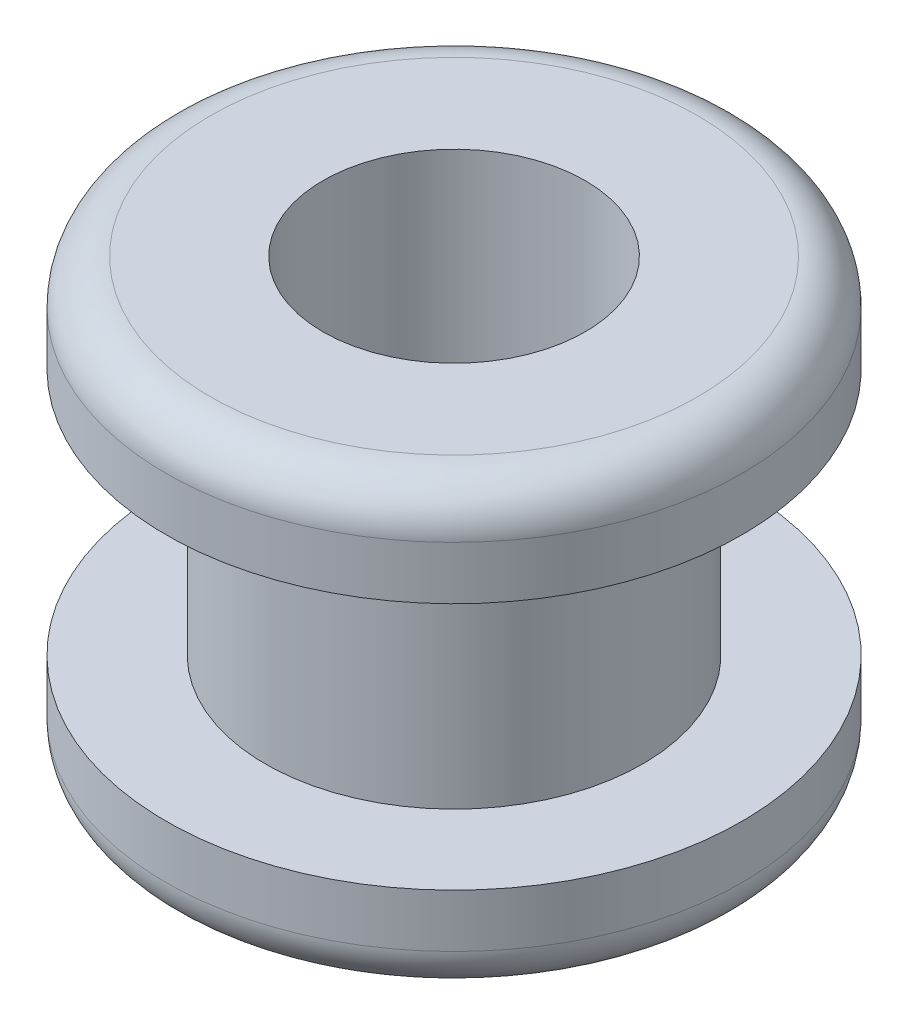
ISO-10303-21;
HEADER;
FILE_DESCRIPTION(('STEP AP214'),'2;1');
FILE_NAME('part.step','',(''),(''),'','','');
FILE_SCHEMA(('AUTOMOTIVE_DESIGN { 1 0 10303 214 1 1 1 1 }'));
ENDSEC;
DATA;
#1=APPLICATION_CONTEXT('core data for automotive mechanical design processes');
#2=APPLICATION_PROTOCOL_DEFINITION('international standard','automotive_design',2000,#1);
#3=PRODUCT_CONTEXT('',#1,'mechanical');
#4=PRODUCT('Part','Part','',(#3));
#5=PRODUCT_RELATED_PRODUCT_CATEGORY('part','',(#4));
#6=PRODUCT_DEFINITION_FORMATION('','',#4);
#7=PRODUCT_DEFINITION_CONTEXT('part definition',#1,'design');
#8=PRODUCT_DEFINITION('design','',#6,#7);
#9=PRODUCT_DEFINITION_SHAPE('','',#8);
#10=(LENGTH_UNIT() NAMED_UNIT(*) SI_UNIT(.MILLI.,.METRE.));
#11=(NAMED_UNIT(*) PLANE_ANGLE_UNIT() SI_UNIT($,.RADIAN.));
#12=(NAMED_UNIT(*) SI_UNIT($,.STERADIAN.) SOLID_ANGLE_UNIT());
#13=UNCERTAINTY_MEASURE_WITH_UNIT(LENGTH_MEASURE(1.E-05),#10,'distance_accuracy_value','');
#14=(GEOMETRIC_REPRESENTATION_CONTEXT(3) GLOBAL_UNCERTAINTY_ASSIGNED_CONTEXT((#13)) GLOBAL_UNIT_ASSIGNED_CONTEXT((#10,
#11,#12)) REPRESENTATION_CONTEXT('',''));
#15=CARTESIAN_POINT('',(0.,0.,0.));
#16=DIRECTION('',(0.,0.,1.));
#17=DIRECTION('',(1.,0.,0.));
#18=AXIS2_PLACEMENT_3D('',#15,#16,#17);
#19=CARTESIAN_POINT('',(0.,0.,0.));
#20=DIRECTION('',(0.,-1.,0.));
#21=DIRECTION('',(0.,0.,-1.));
#22=AXIS2_PLACEMENT_3D('',#19,#20,#21);
#23=CYLINDRICAL_SURFACE('',#22,1.48);
#24=CARTESIAN_POINT('',(0.,2.5,0.));
#25=DIRECTION('',(0.,-1.,0.));
#26=DIRECTION('',(0.,0.,-1.));
#27=AXIS2_PLACEMENT_3D('',#24,#25,#26);
#28=CIRCLE('',#27,1.48);
#29=CARTESIAN_POINT('',(0.,2.5,-1.48));
#30=VERTEX_POINT('',#29);
#31=EDGE_CURVE('E10',#30,#30,#28,.T.);
#32=ORIENTED_EDGE('',*,*,#31,.F.);
#33=EDGE_LOOP('',(#32));
#34=FACE_BOUND('',#33,.T.);
#35=CARTESIAN_POINT('',(0.,-2.5,0.));
#36=DIRECTION('',(0.,-1.,0.));
#37=DIRECTION('',(0.,0.,-1.));
#38=AXIS2_PLACEMENT_3D('',#35,#36,#37);
#39=CIRCLE('',#38,1.48);
#40=CARTESIAN_POINT('',(0.,-2.5,-1.48));
#41=VERTEX_POINT('',#40);
#42=EDGE_CURVE('E65',#41,#41,#39,.T.);
#43=ORIENTED_EDGE('',*,*,#42,.T.);
#44=EDGE_LOOP('',(#43));
#45=FACE_BOUND('',#44,.T.);
#46=ADVANCED_FACE('F31',(#34,#45),#23,.F.);
#47=CARTESIAN_POINT('',(-2.75,2.5,0.));
#48=DIRECTION('',(0.,-1.,0.));
#49=DIRECTION('',(0.,0.,-1.));
#50=AXIS2_PLACEMENT_3D('',#47,#48,#49);
#51=PLANE('',#50);
#52=CARTESIAN_POINT('',(0.,2.5,0.));
#53=DIRECTION('',(0.,-1.,0.));
#54=DIRECTION('',(0.,0.,-1.));
#55=AXIS2_PLACEMENT_3D('',#52,#53,#54);
#56=CIRCLE('',#55,2.75);
#57=CARTESIAN_POINT('',(0.,2.5,-2.75));
#58=VERTEX_POINT('',#57);
#59=EDGE_CURVE('E37',#58,#58,#56,.T.);
#60=ORIENTED_EDGE('',*,*,#59,.F.);
#61=EDGE_LOOP('',(#60));
#62=FACE_BOUND('',#61,.T.);
#63=ORIENTED_EDGE('',*,*,#31,.T.);
#64=EDGE_LOOP('',(#63));
#65=FACE_BOUND('',#64,.T.);
#66=ADVANCED_FACE('F114',(#62,#65),#51,.F.);
#67=CARTESIAN_POINT('',(0.,2.,0.));
#68=DIRECTION('',(0.,-1.,0.));
#69=DIRECTION('',(0.,0.,-1.));
#70=AXIS2_PLACEMENT_3D('',#67,#68,#69);
#71=TOROIDAL_SURFACE('',#70,2.75,0.5);
#72=CARTESIAN_POINT('',(0.,2.,0.));
#73=DIRECTION('',(0.,-1.,0.));
#74=DIRECTION('',(0.,0.,-1.));
#75=AXIS2_PLACEMENT_3D('',#72,#73,#74);
#76=CIRCLE('',#75,3.25);
#77=CARTESIAN_POINT('',(0.,2.,-3.25));
#78=VERTEX_POINT('',#77);
#79=EDGE_CURVE('E41',#78,#78,#76,.T.);
#80=ORIENTED_EDGE('',*,*,#79,.F.);
#81=EDGE_LOOP('',(#80));
#82=FACE_BOUND('',#81,.T.);
#83=ORIENTED_EDGE('',*,*,#59,.T.);
#84=EDGE_LOOP('',(#83));
#85=FACE_BOUND('',#84,.T.);
#86=ADVANCED_FACE('F109',(#82,#85),#71,.T.);
#87=CARTESIAN_POINT('',(0.,0.,0.));
#88=DIRECTION('',(0.,-1.,0.));
#89=DIRECTION('',(0.,0.,-1.));
#90=AXIS2_PLACEMENT_3D('',#87,#88,#89);
#91=CYLINDRICAL_SURFACE('',#90,3.25);
#92=CARTESIAN_POINT('',(0.,1.4,0.));
#93=DIRECTION('',(0.,-1.,0.));
#94=DIRECTION('',(0.,0.,-1.));
#95=AXIS2_PLACEMENT_3D('',#92,#93,#94);
#96=CIRCLE('',#95,3.25);
#97=CARTESIAN_POINT('',(0.,1.4,-3.25));
#98=VERTEX_POINT('',#97);
#99=EDGE_CURVE('E45',#98,#98,#96,.T.);
#100=ORIENTED_EDGE('',*,*,#99,.F.);
#101=EDGE_LOOP('',(#100));
#102=FACE_BOUND('',#101,.T.);
#103=ORIENTED_EDGE('',*,*,#79,.T.);
#104=EDGE_LOOP('',(#103));
#105=FACE_BOUND('',#104,.T.);
#106=ADVANCED_FACE('F103',(#102,#105),#91,.T.);
#107=CARTESIAN_POINT('',(-3.25,1.4,0.));
#108=DIRECTION('',(0.,1.,0.));
#109=DIRECTION('',(0.,0.,1.));
#110=AXIS2_PLACEMENT_3D('',#107,#108,#109);
#111=PLANE('',#110);
#112=CARTESIAN_POINT('',(0.,1.4,0.));
#113=DIRECTION('',(0.,-1.,0.));
#114=DIRECTION('',(0.,0.,-1.));
#115=AXIS2_PLACEMENT_3D('',#112,#113,#114);
#116=CIRCLE('',#115,2.13);
#117=CARTESIAN_POINT('',(0.,1.4,-2.13));
#118=VERTEX_POINT('',#117);
#119=EDGE_CURVE('E50',#118,#118,#116,.T.);
#120=ORIENTED_EDGE('',*,*,#119,.F.);
#121=EDGE_LOOP('',(#120));
#122=FACE_BOUND('',#121,.T.);
#123=ORIENTED_EDGE('',*,*,#99,.T.);
#124=EDGE_LOOP('',(#123));
#125=FACE_BOUND('',#124,.T.);
#126=ADVANCED_FACE('F97',(#122,#125),#111,.F.);
#127=CARTESIAN_POINT('',(0.,0.,0.));
#128=DIRECTION('',(0.,-1.,0.));
#129=DIRECTION('',(0.,0.,-1.));
#130=AXIS2_PLACEMENT_3D('',#127,#128,#129);
#131=CYLINDRICAL_SURFACE('',#130,2.13);
#132=CARTESIAN_POINT('',(0.,-1.4,0.));
#133=DIRECTION('',(0.,-1.,0.));
#134=DIRECTION('',(0.,0.,-1.));
#135=AXIS2_PLACEMENT_3D('',#132,#133,#134);
#136=CIRCLE('',#135,2.13);
#137=CARTESIAN_POINT('',(0.,-1.4,-2.13));
#138=VERTEX_POINT('',#137);
#139=EDGE_CURVE('E53',#138,#138,#136,.T.);
#140=ORIENTED_EDGE('',*,*,#139,.F.);
#141=EDGE_LOOP('',(#140));
#142=FACE_BOUND('',#141,.T.);
#143=ORIENTED_EDGE('',*,*,#119,.T.);
#144=EDGE_LOOP('',(#143));
#145=FACE_BOUND('',#144,.T.);
#146=ADVANCED_FACE('F91',(#142,#145),#131,.T.);
#147=CARTESIAN_POINT('',(-3.25,-1.4,0.));
#148=DIRECTION('',(0.,-1.,0.));
#149=DIRECTION('',(0.,0.,-1.));
#150=AXIS2_PLACEMENT_3D('',#147,#148,#149);
#151=PLANE('',#150);
#152=CARTESIAN_POINT('',(0.,-1.4,0.));
#153=DIRECTION('',(0.,-1.,0.));
#154=DIRECTION('',(0.,0.,-1.));
#155=AXIS2_PLACEMENT_3D('',#152,#153,#154);
#156=CIRCLE('',#155,3.25);
#157=CARTESIAN_POINT('',(0.,-1.4,-3.25));
#158=VERTEX_POINT('',#157);
#159=EDGE_CURVE('E56',#158,#158,#156,.T.);
#160=ORIENTED_EDGE('',*,*,#159,.F.);
#161=EDGE_LOOP('',(#160));
#162=FACE_BOUND('',#161,.T.);
#163=ORIENTED_EDGE('',*,*,#139,.T.);
#164=EDGE_LOOP('',(#163));
#165=FACE_BOUND('',#164,.T.);
#166=ADVANCED_FACE('F85',(#162,#165),#151,.F.);
#167=CARTESIAN_POINT('',(0.,0.,0.));
#168=DIRECTION('',(0.,-1.,0.));
#169=DIRECTION('',(0.,0.,-1.));
#170=AXIS2_PLACEMENT_3D('',#167,#168,#169);
#171=CYLINDRICAL_SURFACE('',#170,3.25);
#172=CARTESIAN_POINT('',(0.,-2.,0.));
#173=DIRECTION('',(0.,-1.,0.));
#174=DIRECTION('',(0.,0.,-1.));
#175=AXIS2_PLACEMENT_3D('',#172,#173,#174);
#176=CIRCLE('',#175,3.25);
#177=CARTESIAN_POINT('',(0.,-2.,-3.25));
#178=VERTEX_POINT('',#177);
#179=EDGE_CURVE('E59',#178,#178,#176,.T.);
#180=ORIENTED_EDGE('',*,*,#179,.F.);
#181=EDGE_LOOP('',(#180));
#182=FACE_BOUND('',#181,.T.);
#183=ORIENTED_EDGE('',*,*,#159,.T.);
#184=EDGE_LOOP('',(#183));
#185=FACE_BOUND('',#184,.T.);
#186=ADVANCED_FACE('F79',(#182,#185),#171,.T.);
#187=CARTESIAN_POINT('',(0.,-2.,0.));
#188=DIRECTION('',(0.,-1.,0.));
#189=DIRECTION('',(0.,0.,-1.));
#190=AXIS2_PLACEMENT_3D('',#187,#188,#189);
#191=TOROIDAL_SURFACE('',#190,2.75,0.5);
#192=CARTESIAN_POINT('',(0.,-2.5,0.));
#193=DIRECTION('',(0.,-1.,0.));
#194=DIRECTION('',(0.,0.,-1.));
#195=AXIS2_PLACEMENT_3D('',#192,#193,#194);
#196=CIRCLE('',#195,2.75);
#197=CARTESIAN_POINT('',(0.,-2.5,-2.75));
#198=VERTEX_POINT('',#197);
#199=EDGE_CURVE('E62',#198,#198,#196,.T.);
#200=ORIENTED_EDGE('',*,*,#199,.F.);
#201=EDGE_LOOP('',(#200));
#202=FACE_BOUND('',#201,.T.);
#203=ORIENTED_EDGE('',*,*,#179,.T.);
#204=EDGE_LOOP('',(#203));
#205=FACE_BOUND('',#204,.T.);
#206=ADVANCED_FACE('F73',(#202,#205),#191,.T.);
#207=CARTESIAN_POINT('',(-2.75,-2.5,0.));
#208=DIRECTION('',(0.,1.,0.));
#209=DIRECTION('',(0.,0.,1.));
#210=AXIS2_PLACEMENT_3D('',#207,#208,#209);
#211=PLANE('',#210);
#212=ORIENTED_EDGE('',*,*,#42,.F.);
#213=EDGE_LOOP('',(#212));
#214=FACE_BOUND('',#213,.T.);
#215=ORIENTED_EDGE('',*,*,#199,.T.);
#216=EDGE_LOOP('',(#215));
#217=FACE_BOUND('',#216,.T.);
#218=ADVANCED_FACE('F70',(#214,#217),#211,.F.);
#219=CLOSED_SHELL('',(#46,#66,#86,#106,#126,#146,#166,#186,#206,#218));
#220=MANIFOLD_SOLID_BREP('B2',#219);
#221=ADVANCED_BREP_SHAPE_REPRESENTATION('',(#18,#220),#14);
#222=SHAPE_DEFINITION_REPRESENTATION(#9,#221);
ENDSEC;
END-ISO-10303-21;
